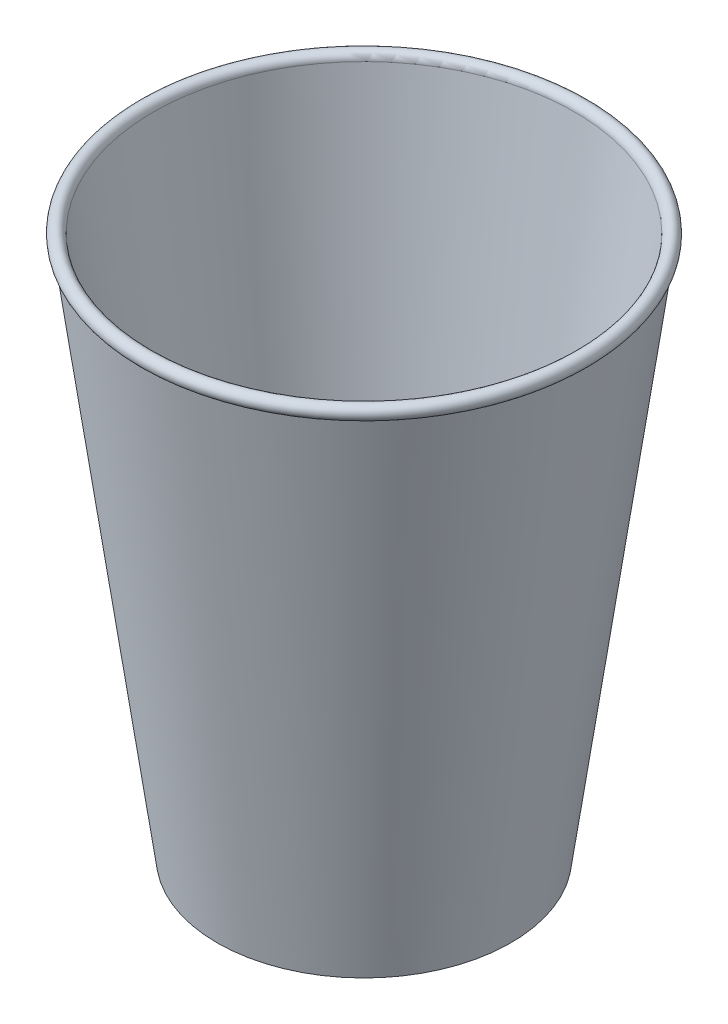
ISO-10303-21;
HEADER;
FILE_DESCRIPTION(('STEP AP214'),'2;1');
FILE_NAME('part.step','',(''),(''),'','','');
FILE_SCHEMA(('AUTOMOTIVE_DESIGN { 1 0 10303 214 1 1 1 1 }'));
ENDSEC;
DATA;
#1=APPLICATION_CONTEXT('core data for automotive mechanical design processes');
#2=APPLICATION_PROTOCOL_DEFINITION('international standard','automotive_design',2000,#1);
#3=PRODUCT_CONTEXT('',#1,'mechanical');
#4=PRODUCT('Part','Part','',(#3));
#5=PRODUCT_RELATED_PRODUCT_CATEGORY('part','',(#4));
#6=PRODUCT_DEFINITION_FORMATION('','',#4);
#7=PRODUCT_DEFINITION_CONTEXT('part definition',#1,'design');
#8=PRODUCT_DEFINITION('design','',#6,#7);
#9=PRODUCT_DEFINITION_SHAPE('','',#8);
#10=(LENGTH_UNIT() NAMED_UNIT(*) SI_UNIT(.MILLI.,.METRE.));
#11=(NAMED_UNIT(*) PLANE_ANGLE_UNIT() SI_UNIT($,.RADIAN.));
#12=(NAMED_UNIT(*) SI_UNIT($,.STERADIAN.) SOLID_ANGLE_UNIT());
#13=UNCERTAINTY_MEASURE_WITH_UNIT(LENGTH_MEASURE(1.E-05),#10,'distance_accuracy_value','');
#14=(GEOMETRIC_REPRESENTATION_CONTEXT(3) GLOBAL_UNCERTAINTY_ASSIGNED_CONTEXT((#13)) GLOBAL_UNIT_ASSIGNED_CONTEXT((#10,
#11,#12)) REPRESENTATION_CONTEXT('',''));
#15=CARTESIAN_POINT('',(0.,0.,0.));
#16=DIRECTION('',(0.,0.,1.));
#17=DIRECTION('',(1.,0.,0.));
#18=AXIS2_PLACEMENT_3D('',#15,#16,#17);
#19=CARTESIAN_POINT('',(-27.7542178808023,-58.6734985334281,0.));
#20=DIRECTION('',(0.,1.,0.));
#21=DIRECTION('',(0.,0.,1.));
#22=AXIS2_PLACEMENT_3D('',#19,#20,#21);
#23=PLANE('',#22);
#24=CARTESIAN_POINT('',(0.,-58.6734985334281,0.));
#25=DIRECTION('',(0.,1.,0.));
#26=DIRECTION('',(0.,0.,1.));
#27=AXIS2_PLACEMENT_3D('',#24,#25,#26);
#28=CIRCLE('',#27,27.7542178808023);
#29=CARTESIAN_POINT('',(0.,-58.6734985334281,27.7542178808023));
#30=VERTEX_POINT('',#29);
#31=EDGE_CURVE('E10',#30,#30,#28,.T.);
#32=ORIENTED_EDGE('',*,*,#31,.T.);
#33=EDGE_LOOP('',(#32));
#34=FACE_BOUND('',#33,.T.);
#35=ADVANCED_FACE('F32',(#34),#23,.T.);
#36=CARTESIAN_POINT('',(0.,-58.6734985334281,0.));
#37=DIRECTION('',(0.,1.,0.));
#38=DIRECTION('',(0.,0.,1.));
#39=AXIS2_PLACEMENT_3D('',#36,#37,#38);
#40=CONICAL_SURFACE('',#39,27.7542178808023,0.135527713985501);
#41=CARTESIAN_POINT('',(0.,47.9008044374293,0.));
#42=DIRECTION('',(0.,1.,0.));
#43=DIRECTION('',(0.,0.,1.));
#44=AXIS2_PLACEMENT_3D('',#41,#42,#43);
#45=CIRCLE('',#44,42.2870773768283);
#46=CARTESIAN_POINT('',(0.,47.9008044374293,42.2870773768283));
#47=VERTEX_POINT('',#46);
#48=EDGE_CURVE('E38',#47,#47,#45,.T.);
#49=ORIENTED_EDGE('',*,*,#48,.T.);
#50=EDGE_LOOP('',(#49));
#51=FACE_BOUND('',#50,.T.);
#52=ORIENTED_EDGE('',*,*,#31,.F.);
#53=EDGE_LOOP('',(#52));
#54=FACE_BOUND('',#53,.T.);
#55=ADVANCED_FACE('F64',(#51,#54),#40,.F.);
#56=CARTESIAN_POINT('',(0.,47.9365601175554,0.));
#57=DIRECTION('',(0.,1.,0.));
#58=DIRECTION('',(0.,0.,1.));
#59=AXIS2_PLACEMENT_3D('',#56,#57,#58);
#60=TOROIDAL_SURFACE('',#59,43.6840819278707,1.39746205111063);
#61=CARTESIAN_POINT('',(0.,46.6121029544826,0.));
#62=DIRECTION('',(0.,1.,0.));
#63=DIRECTION('',(0.,0.,1.));
#64=AXIS2_PLACEMENT_3D('',#61,#62,#63);
#65=CIRCLE('',#64,44.1298547483514);
#66=CARTESIAN_POINT('',(0.,46.6121029544826,44.1298547483514));
#67=VERTEX_POINT('',#66);
#68=EDGE_CURVE('E42',#67,#67,#65,.T.);
#69=ORIENTED_EDGE('',*,*,#68,.T.);
#70=EDGE_LOOP('',(#69));
#71=FACE_BOUND('',#70,.T.);
#72=ORIENTED_EDGE('',*,*,#48,.F.);
#73=EDGE_LOOP('',(#72));
#74=FACE_BOUND('',#73,.T.);
#75=ADVANCED_FACE('F61',(#71,#74),#60,.T.);
#76=CARTESIAN_POINT('',(0.,46.6121029544826,0.));
#77=DIRECTION('',(0.,1.,0.));
#78=DIRECTION('',(0.,0.,1.));
#79=AXIS2_PLACEMENT_3D('',#76,#77,#78);
#80=CONICAL_SURFACE('',#79,44.1298547483514,0.135527713985501);
#81=CARTESIAN_POINT('',(0.,-60.6734985334281,0.));
#82=DIRECTION('',(0.,1.,0.));
#83=DIRECTION('',(0.,0.,1.));
#84=AXIS2_PLACEMENT_3D('',#81,#82,#83);
#85=CIRCLE('',#84,29.5);
#86=CARTESIAN_POINT('',(0.,-60.6734985334281,29.5));
#87=VERTEX_POINT('',#86);
#88=EDGE_CURVE('E46',#87,#87,#85,.T.);
#89=ORIENTED_EDGE('',*,*,#88,.T.);
#90=EDGE_LOOP('',(#89));
#91=FACE_BOUND('',#90,.T.);
#92=ORIENTED_EDGE('',*,*,#68,.F.);
#93=EDGE_LOOP('',(#92));
#94=FACE_BOUND('',#93,.T.);
#95=ADVANCED_FACE('F52',(#91,#94),#80,.T.);
#96=CARTESIAN_POINT('',(0.,-60.6734985334281,0.));
#97=DIRECTION('',(0.,-1.,0.));
#98=DIRECTION('',(0.,0.,-1.));
#99=AXIS2_PLACEMENT_3D('',#96,#97,#98);
#100=PLANE('',#99);
#101=ORIENTED_EDGE('',*,*,#88,.F.);
#102=EDGE_LOOP('',(#101));
#103=FACE_BOUND('',#102,.T.);
#104=ADVANCED_FACE('F55',(#103),#100,.T.);
#105=CLOSED_SHELL('',(#35,#55,#75,#95,#104));
#106=MANIFOLD_SOLID_BREP('B2',#105);
#107=ADVANCED_BREP_SHAPE_REPRESENTATION('',(#18,#106),#14);
#108=SHAPE_DEFINITION_REPRESENTATION(#9,#107);
ENDSEC;
END-ISO-10303-21;
